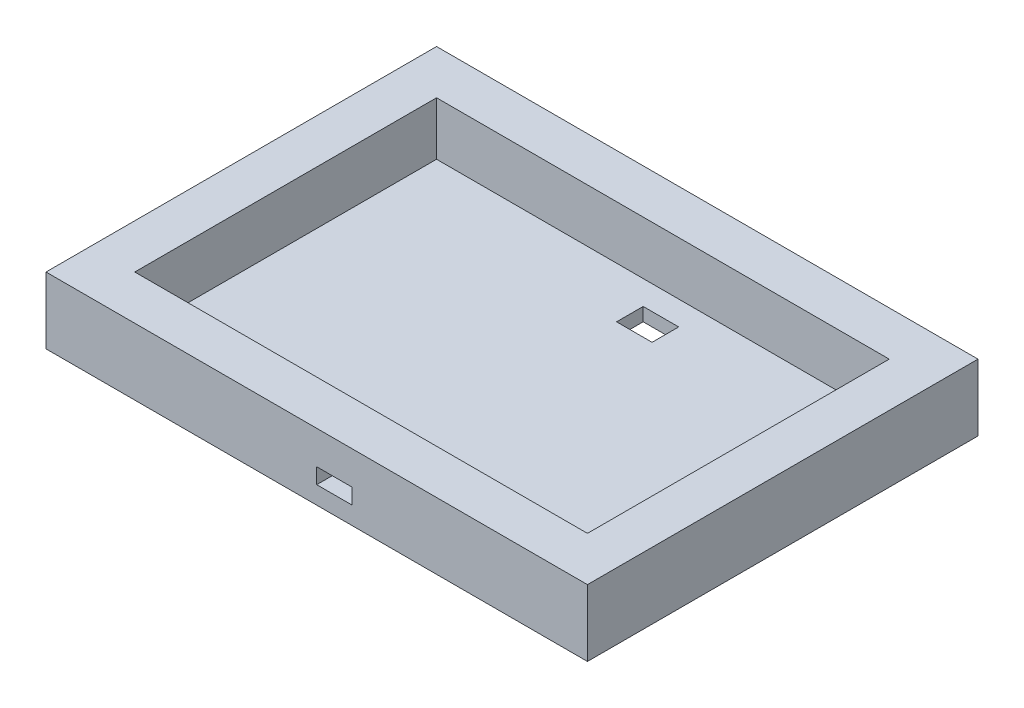
ISO-10303-21;
HEADER;
FILE_DESCRIPTION(('STEP AP214'),'2;1');
FILE_NAME('part.step','',(''),(''),'','','');
FILE_SCHEMA(('AUTOMOTIVE_DESIGN { 1 0 10303 214 1 1 1 1 }'));
ENDSEC;
DATA;
#1=APPLICATION_CONTEXT('core data for automotive mechanical design processes');
#2=APPLICATION_PROTOCOL_DEFINITION('international standard','automotive_design',2000,#1);
#3=PRODUCT_CONTEXT('',#1,'mechanical');
#4=PRODUCT('Part','Part','',(#3));
#5=PRODUCT_RELATED_PRODUCT_CATEGORY('part','',(#4));
#6=PRODUCT_DEFINITION_FORMATION('','',#4);
#7=PRODUCT_DEFINITION_CONTEXT('part definition',#1,'design');
#8=PRODUCT_DEFINITION('design','',#6,#7);
#9=PRODUCT_DEFINITION_SHAPE('','',#8);
#10=(LENGTH_UNIT() NAMED_UNIT(*) SI_UNIT(.MILLI.,.METRE.));
#11=(NAMED_UNIT(*) PLANE_ANGLE_UNIT() SI_UNIT($,.RADIAN.));
#12=(NAMED_UNIT(*) SI_UNIT($,.STERADIAN.) SOLID_ANGLE_UNIT());
#13=UNCERTAINTY_MEASURE_WITH_UNIT(LENGTH_MEASURE(1.E-05),#10,'distance_accuracy_value','');
#14=(GEOMETRIC_REPRESENTATION_CONTEXT(3) GLOBAL_UNCERTAINTY_ASSIGNED_CONTEXT((#13)) GLOBAL_UNIT_ASSIGNED_CONTEXT((#10,
#11,#12)) REPRESENTATION_CONTEXT('',''));
#15=CARTESIAN_POINT('',(0.,0.,0.));
#16=DIRECTION('',(0.,0.,1.));
#17=DIRECTION('',(1.,0.,0.));
#18=AXIS2_PLACEMENT_3D('',#15,#16,#17);
#19=CARTESIAN_POINT('',(-92.6082870260368,15.,47.5446963193695));
#20=DIRECTION('',(0.,0.,-1.));
#21=DIRECTION('',(-1.,0.,0.));
#22=AXIS2_PLACEMENT_3D('',#19,#20,#21);
#23=PLANE('',#22);
#24=DIRECTION('',(1.,0.,0.));
#25=VECTOR('',#24,1.);
#26=CARTESIAN_POINT('',(-92.6082870260368,0.,47.5446963193695));
#27=LINE('',#26,#25);
#28=CARTESIAN_POINT('',(-92.6082870260368,0.,47.5446963193695));
#29=VERTEX_POINT('',#28);
#30=CARTESIAN_POINT('',(29.3917129739632,0.,47.5446963193695));
#31=VERTEX_POINT('',#30);
#32=EDGE_CURVE('E306',#29,#31,#27,.T.);
#33=ORIENTED_EDGE('',*,*,#32,.T.);
#34=DIRECTION('',(0.,-1.,0.));
#35=VECTOR('',#34,1.);
#36=CARTESIAN_POINT('',(29.3917129739632,15.,47.5446963193695));
#37=LINE('',#36,#35);
#38=CARTESIAN_POINT('',(29.3917129739632,15.,47.5446963193695));
#39=VERTEX_POINT('',#38);
#40=EDGE_CURVE('E48',#39,#31,#37,.T.);
#41=ORIENTED_EDGE('',*,*,#40,.F.);
#42=DIRECTION('',(1.,0.,0.));
#43=VECTOR('',#42,1.);
#44=CARTESIAN_POINT('',(-92.6082870260368,15.,47.5446963193695));
#45=LINE('',#44,#43);
#46=CARTESIAN_POINT('',(-92.6082870260368,15.,47.5446963193695));
#47=VERTEX_POINT('',#46);
#48=EDGE_CURVE('E292',#47,#39,#45,.T.);
#49=ORIENTED_EDGE('',*,*,#48,.F.);
#50=DIRECTION('',(0.,-1.,0.));
#51=VECTOR('',#50,1.);
#52=CARTESIAN_POINT('',(-92.6082870260368,15.,47.5446963193695));
#53=LINE('',#52,#51);
#54=EDGE_CURVE('E11',#47,#29,#53,.T.);
#55=ORIENTED_EDGE('',*,*,#54,.T.);
#56=EDGE_LOOP('',(#33,#41,#49,#55));
#57=FACE_BOUND('',#56,.T.);
#58=DIRECTION('',(0.,-1.,0.));
#59=VECTOR('',#58,1.);
#60=CARTESIAN_POINT('',(-31.6082870260368,15.,47.5446963193695));
#61=LINE('',#60,#59);
#62=CARTESIAN_POINT('',(-31.6082870260368,7.49999999999999,47.5446963193695));
#63=VERTEX_POINT('',#62);
#64=CARTESIAN_POINT('',(-31.6082870260368,3.99999999999999,47.5446963193695));
#65=VERTEX_POINT('',#64);
#66=EDGE_CURVE('E240',#63,#65,#61,.T.);
#67=ORIENTED_EDGE('',*,*,#66,.F.);
#68=DIRECTION('',(-1.,0.,0.));
#69=VECTOR('',#68,1.);
#70=CARTESIAN_POINT('',(-92.6082870260368,7.49999999999998,47.5446963193695));
#71=LINE('',#70,#69);
#72=CARTESIAN_POINT('',(-23.6082870260368,7.49999999999999,47.5446963193695));
#73=VERTEX_POINT('',#72);
#74=EDGE_CURVE('E230',#73,#63,#71,.T.);
#75=ORIENTED_EDGE('',*,*,#74,.F.);
#76=DIRECTION('',(0.,1.,0.));
#77=VECTOR('',#76,1.);
#78=CARTESIAN_POINT('',(-23.6082870260368,14.9999999999999,47.5446963193695));
#79=LINE('',#78,#77);
#80=CARTESIAN_POINT('',(-23.6082870260368,3.99999999999999,47.5446963193695));
#81=VERTEX_POINT('',#80);
#82=EDGE_CURVE('E233',#81,#73,#79,.T.);
#83=ORIENTED_EDGE('',*,*,#82,.F.);
#84=DIRECTION('',(1.,0.,0.));
#85=VECTOR('',#84,1.);
#86=CARTESIAN_POINT('',(-92.6082870260368,3.99999999999999,47.5446963193695));
#87=LINE('',#86,#85);
#88=EDGE_CURVE('E237',#65,#81,#87,.T.);
#89=ORIENTED_EDGE('',*,*,#88,.F.);
#90=EDGE_LOOP('',(#67,#75,#83,#89));
#91=FACE_BOUND('',#90,.T.);
#92=ADVANCED_FACE('F39',(#57,#91),#23,.F.);
#93=CARTESIAN_POINT('',(-82.6082870260368,15.,37.5446963193695));
#94=DIRECTION('',(0.,0.,-1.));
#95=DIRECTION('',(-1.,0.,0.));
#96=AXIS2_PLACEMENT_3D('',#93,#94,#95);
#97=PLANE('',#96);
#98=DIRECTION('',(1.,0.,0.));
#99=VECTOR('',#98,1.);
#100=CARTESIAN_POINT('',(-82.6082870260368,3.,37.5446963193695));
#101=LINE('',#100,#99);
#102=CARTESIAN_POINT('',(-82.6082870260368,3.,37.5446963193695));
#103=VERTEX_POINT('',#102);
#104=CARTESIAN_POINT('',(19.3917129739632,3.,37.5446963193695));
#105=VERTEX_POINT('',#104);
#106=EDGE_CURVE('E247',#103,#105,#101,.T.);
#107=ORIENTED_EDGE('',*,*,#106,.F.);
#108=DIRECTION('',(0.,-1.,0.));
#109=VECTOR('',#108,1.);
#110=CARTESIAN_POINT('',(-82.6082870260368,15.,37.5446963193695));
#111=LINE('',#110,#109);
#112=CARTESIAN_POINT('',(-82.6082870260368,15.,37.5446963193695));
#113=VERTEX_POINT('',#112);
#114=EDGE_CURVE('E283',#113,#103,#111,.T.);
#115=ORIENTED_EDGE('',*,*,#114,.F.);
#116=DIRECTION('',(1.,0.,0.));
#117=VECTOR('',#116,1.);
#118=CARTESIAN_POINT('',(-82.6082870260368,15.,37.5446963193695));
#119=LINE('',#118,#117);
#120=CARTESIAN_POINT('',(19.3917129739632,15.,37.5446963193695));
#121=VERTEX_POINT('',#120);
#122=EDGE_CURVE('E262',#113,#121,#119,.T.);
#123=ORIENTED_EDGE('',*,*,#122,.T.);
#124=DIRECTION('',(0.,-1.,0.));
#125=VECTOR('',#124,1.);
#126=CARTESIAN_POINT('',(19.3917129739632,15.,37.5446963193695));
#127=LINE('',#126,#125);
#128=EDGE_CURVE('E279',#121,#105,#127,.T.);
#129=ORIENTED_EDGE('',*,*,#128,.T.);
#130=EDGE_LOOP('',(#107,#115,#123,#129));
#131=FACE_BOUND('',#130,.T.);
#132=DIRECTION('',(-1.,0.,0.));
#133=VECTOR('',#132,1.);
#134=CARTESIAN_POINT('',(-23.6082870260368,7.49999999999999,37.5446963193695));
#135=LINE('',#134,#133);
#136=CARTESIAN_POINT('',(-23.6082870260368,7.49999999999999,37.5446963193695));
#137=VERTEX_POINT('',#136);
#138=CARTESIAN_POINT('',(-31.6082870260368,7.49999999999999,37.5446963193695));
#139=VERTEX_POINT('',#138);
#140=EDGE_CURVE('E211',#137,#139,#135,.T.);
#141=ORIENTED_EDGE('',*,*,#140,.T.);
#142=DIRECTION('',(0.,-1.,0.));
#143=VECTOR('',#142,1.);
#144=CARTESIAN_POINT('',(-31.6082870260368,3.99999999999999,37.5446963193695));
#145=LINE('',#144,#143);
#146=CARTESIAN_POINT('',(-31.6082870260368,3.99999999999999,37.5446963193695));
#147=VERTEX_POINT('',#146);
#148=EDGE_CURVE('E196',#139,#147,#145,.T.);
#149=ORIENTED_EDGE('',*,*,#148,.T.);
#150=DIRECTION('',(1.,0.,0.));
#151=VECTOR('',#150,1.);
#152=CARTESIAN_POINT('',(-23.6082870260368,3.99999999999999,37.5446963193695));
#153=LINE('',#152,#151);
#154=CARTESIAN_POINT('',(-23.6082870260368,3.99999999999999,37.5446963193695));
#155=VERTEX_POINT('',#154);
#156=EDGE_CURVE('E202',#147,#155,#153,.T.);
#157=ORIENTED_EDGE('',*,*,#156,.T.);
#158=DIRECTION('',(0.,1.,0.));
#159=VECTOR('',#158,1.);
#160=CARTESIAN_POINT('',(-23.6082870260368,3.99999999999999,37.5446963193695));
#161=LINE('',#160,#159);
#162=EDGE_CURVE('E207',#155,#137,#161,.T.);
#163=ORIENTED_EDGE('',*,*,#162,.T.);
#164=EDGE_LOOP('',(#141,#149,#157,#163));
#165=FACE_BOUND('',#164,.T.);
#166=ADVANCED_FACE('F343',(#131,#165),#97,.T.);
#167=CARTESIAN_POINT('',(0.,15.,0.));
#168=DIRECTION('',(0.,1.,0.));
#169=DIRECTION('',(0.,0.,1.));
#170=AXIS2_PLACEMENT_3D('',#167,#168,#169);
#171=PLANE('',#170);
#172=DIRECTION('',(0.,0.,1.));
#173=VECTOR('',#172,1.);
#174=CARTESIAN_POINT('',(-92.6082870260368,15.,-40.4553036806305));
#175=LINE('',#174,#173);
#176=CARTESIAN_POINT('',(-92.6082870260368,15.,-40.4553036806305));
#177=VERTEX_POINT('',#176);
#178=EDGE_CURVE('E288',#177,#47,#175,.T.);
#179=ORIENTED_EDGE('',*,*,#178,.T.);
#180=ORIENTED_EDGE('',*,*,#48,.T.);
#181=DIRECTION('',(0.,0.,-1.));
#182=VECTOR('',#181,1.);
#183=CARTESIAN_POINT('',(29.3917129739632,15.,-40.4553036806305));
#184=LINE('',#183,#182);
#185=CARTESIAN_POINT('',(29.3917129739632,15.,-40.4553036806305));
#186=VERTEX_POINT('',#185);
#187=EDGE_CURVE('E296',#39,#186,#184,.T.);
#188=ORIENTED_EDGE('',*,*,#187,.T.);
#189=DIRECTION('',(-1.,0.,0.));
#190=VECTOR('',#189,1.);
#191=CARTESIAN_POINT('',(-92.6082870260368,15.,-40.4553036806305));
#192=LINE('',#191,#190);
#193=EDGE_CURVE('E299',#186,#177,#192,.T.);
#194=ORIENTED_EDGE('',*,*,#193,.T.);
#195=EDGE_LOOP('',(#179,#180,#188,#194));
#196=FACE_BOUND('',#195,.T.);
#197=ORIENTED_EDGE('',*,*,#122,.F.);
#198=DIRECTION('',(0.,0.,1.));
#199=VECTOR('',#198,1.);
#200=CARTESIAN_POINT('',(-82.6082870260368,15.,-30.4553036806305));
#201=LINE('',#200,#199);
#202=CARTESIAN_POINT('',(-82.6082870260368,15.,-30.4553036806305));
#203=VERTEX_POINT('',#202);
#204=EDGE_CURVE('E259',#203,#113,#201,.T.);
#205=ORIENTED_EDGE('',*,*,#204,.F.);
#206=DIRECTION('',(-1.,0.,0.));
#207=VECTOR('',#206,1.);
#208=CARTESIAN_POINT('',(-82.6082870260368,15.,-30.4553036806305));
#209=LINE('',#208,#207);
#210=CARTESIAN_POINT('',(19.3917129739632,15.,-30.4553036806305));
#211=VERTEX_POINT('',#210);
#212=EDGE_CURVE('E269',#211,#203,#209,.T.);
#213=ORIENTED_EDGE('',*,*,#212,.F.);
#214=DIRECTION('',(0.,0.,-1.));
#215=VECTOR('',#214,1.);
#216=CARTESIAN_POINT('',(19.3917129739632,15.,-30.4553036806305));
#217=LINE('',#216,#215);
#218=EDGE_CURVE('E265',#121,#211,#217,.T.);
#219=ORIENTED_EDGE('',*,*,#218,.F.);
#220=EDGE_LOOP('',(#197,#205,#213,#219));
#221=FACE_BOUND('',#220,.T.);
#222=ADVANCED_FACE('F339',(#196,#221),#171,.T.);
#223=CARTESIAN_POINT('',(0.,0.,0.));
#224=DIRECTION('',(0.,1.,0.));
#225=DIRECTION('',(0.,0.,1.));
#226=AXIS2_PLACEMENT_3D('',#223,#224,#225);
#227=PLANE('',#226);
#228=DIRECTION('',(1.,0.,0.));
#229=VECTOR('',#228,1.);
#230=CARTESIAN_POINT('',(-22.6082870260368,0.,-19.0153036806305));
#231=LINE('',#230,#229);
#232=CARTESIAN_POINT('',(-30.6082870260368,0.,-19.0153036806305));
#233=VERTEX_POINT('',#232);
#234=CARTESIAN_POINT('',(-22.6082870260368,0.,-19.0153036806305));
#235=VERTEX_POINT('',#234);
#236=EDGE_CURVE('E162',#233,#235,#231,.T.);
#237=ORIENTED_EDGE('',*,*,#236,.T.);
#238=DIRECTION('',(0.,0.,-1.));
#239=VECTOR('',#238,1.);
#240=CARTESIAN_POINT('',(-22.6082870260368,0.,-25.0153036806305));
#241=LINE('',#240,#239);
#242=CARTESIAN_POINT('',(-22.6082870260368,0.,-25.0153036806305));
#243=VERTEX_POINT('',#242);
#244=EDGE_CURVE('E155',#235,#243,#241,.T.);
#245=ORIENTED_EDGE('',*,*,#244,.T.);
#246=DIRECTION('',(-1.,0.,0.));
#247=VECTOR('',#246,1.);
#248=CARTESIAN_POINT('',(-22.6082870260368,0.,-25.0153036806305));
#249=LINE('',#248,#247);
#250=CARTESIAN_POINT('',(-30.6082870260368,0.,-25.0153036806305));
#251=VERTEX_POINT('',#250);
#252=EDGE_CURVE('E165',#243,#251,#249,.T.);
#253=ORIENTED_EDGE('',*,*,#252,.T.);
#254=DIRECTION('',(0.,0.,1.));
#255=VECTOR('',#254,1.);
#256=CARTESIAN_POINT('',(-30.6082870260368,0.,-25.0153036806305));
#257=LINE('',#256,#255);
#258=EDGE_CURVE('E55',#251,#233,#257,.T.);
#259=ORIENTED_EDGE('',*,*,#258,.T.);
#260=EDGE_LOOP('',(#237,#245,#253,#259));
#261=FACE_BOUND('',#260,.T.);
#262=DIRECTION('',(0.,0.,1.));
#263=VECTOR('',#262,1.);
#264=CARTESIAN_POINT('',(-92.6082870260368,0.,-40.4553036806305));
#265=LINE('',#264,#263);
#266=CARTESIAN_POINT('',(-92.6082870260368,0.,-40.4553036806305));
#267=VERTEX_POINT('',#266);
#268=EDGE_CURVE('E287',#267,#29,#265,.T.);
#269=ORIENTED_EDGE('',*,*,#268,.F.);
#270=DIRECTION('',(-1.,0.,0.));
#271=VECTOR('',#270,1.);
#272=CARTESIAN_POINT('',(-92.6082870260368,0.,-40.4553036806305));
#273=LINE('',#272,#271);
#274=CARTESIAN_POINT('',(29.3917129739632,0.,-40.4553036806305));
#275=VERTEX_POINT('',#274);
#276=EDGE_CURVE('E293',#275,#267,#273,.T.);
#277=ORIENTED_EDGE('',*,*,#276,.F.);
#278=DIRECTION('',(0.,0.,-1.));
#279=VECTOR('',#278,1.);
#280=CARTESIAN_POINT('',(29.3917129739632,0.,-40.4553036806305));
#281=LINE('',#280,#279);
#282=EDGE_CURVE('E309',#31,#275,#281,.T.);
#283=ORIENTED_EDGE('',*,*,#282,.F.);
#284=ORIENTED_EDGE('',*,*,#32,.F.);
#285=EDGE_LOOP('',(#269,#277,#283,#284));
#286=FACE_BOUND('',#285,.T.);
#287=ADVANCED_FACE('F170',(#261,#286),#227,.F.);
#288=CARTESIAN_POINT('',(-92.6082870260368,15.,-40.4553036806305));
#289=DIRECTION('',(1.,0.,0.));
#290=DIRECTION('',(0.,0.,-1.));
#291=AXIS2_PLACEMENT_3D('',#288,#289,#290);
#292=PLANE('',#291);
#293=ORIENTED_EDGE('',*,*,#268,.T.);
#294=ORIENTED_EDGE('',*,*,#54,.F.);
#295=ORIENTED_EDGE('',*,*,#178,.F.);
#296=DIRECTION('',(0.,-1.,0.));
#297=VECTOR('',#296,1.);
#298=CARTESIAN_POINT('',(-92.6082870260368,15.,-40.4553036806305));
#299=LINE('',#298,#297);
#300=EDGE_CURVE('E302',#177,#267,#299,.T.);
#301=ORIENTED_EDGE('',*,*,#300,.T.);
#302=EDGE_LOOP('',(#293,#294,#295,#301));
#303=FACE_BOUND('',#302,.T.);
#304=ADVANCED_FACE('F41',(#303),#292,.F.);
#305=CARTESIAN_POINT('',(29.3917129739632,15.,-40.4553036806305));
#306=DIRECTION('',(-1.,0.,0.));
#307=DIRECTION('',(0.,0.,1.));
#308=AXIS2_PLACEMENT_3D('',#305,#306,#307);
#309=PLANE('',#308);
#310=ORIENTED_EDGE('',*,*,#282,.T.);
#311=DIRECTION('',(0.,-1.,0.));
#312=VECTOR('',#311,1.);
#313=CARTESIAN_POINT('',(29.3917129739632,15.,-40.4553036806305));
#314=LINE('',#313,#312);
#315=EDGE_CURVE('E317',#186,#275,#314,.T.);
#316=ORIENTED_EDGE('',*,*,#315,.F.);
#317=ORIENTED_EDGE('',*,*,#187,.F.);
#318=ORIENTED_EDGE('',*,*,#40,.T.);
#319=EDGE_LOOP('',(#310,#316,#317,#318));
#320=FACE_BOUND('',#319,.T.);
#321=ADVANCED_FACE('F326',(#320),#309,.F.);
#322=CARTESIAN_POINT('',(-92.6082870260368,15.,-40.4553036806305));
#323=DIRECTION('',(0.,0.,1.));
#324=DIRECTION('',(1.,0.,0.));
#325=AXIS2_PLACEMENT_3D('',#322,#323,#324);
#326=PLANE('',#325);
#327=ORIENTED_EDGE('',*,*,#276,.T.);
#328=ORIENTED_EDGE('',*,*,#300,.F.);
#329=ORIENTED_EDGE('',*,*,#193,.F.);
#330=ORIENTED_EDGE('',*,*,#315,.T.);
#331=EDGE_LOOP('',(#327,#328,#329,#330));
#332=FACE_BOUND('',#331,.T.);
#333=ADVANCED_FACE('F333',(#332),#326,.F.);
#334=CARTESIAN_POINT('',(-82.6082870260368,15.,-30.4553036806305));
#335=DIRECTION('',(1.,0.,0.));
#336=DIRECTION('',(0.,0.,-1.));
#337=AXIS2_PLACEMENT_3D('',#334,#335,#336);
#338=PLANE('',#337);
#339=DIRECTION('',(0.,0.,1.));
#340=VECTOR('',#339,1.);
#341=CARTESIAN_POINT('',(-82.6082870260368,3.,-30.4553036806305));
#342=LINE('',#341,#340);
#343=CARTESIAN_POINT('',(-82.6082870260368,3.,-30.4553036806305));
#344=VERTEX_POINT('',#343);
#345=EDGE_CURVE('E243',#344,#103,#342,.T.);
#346=ORIENTED_EDGE('',*,*,#345,.F.);
#347=DIRECTION('',(0.,-1.,0.));
#348=VECTOR('',#347,1.);
#349=CARTESIAN_POINT('',(-82.6082870260368,15.,-30.4553036806305));
#350=LINE('',#349,#348);
#351=EDGE_CURVE('E272',#203,#344,#350,.T.);
#352=ORIENTED_EDGE('',*,*,#351,.F.);
#353=ORIENTED_EDGE('',*,*,#204,.T.);
#354=ORIENTED_EDGE('',*,*,#114,.T.);
#355=EDGE_LOOP('',(#346,#352,#353,#354));
#356=FACE_BOUND('',#355,.T.);
#357=ADVANCED_FACE('F386',(#356),#338,.T.);
#358=CARTESIAN_POINT('',(19.3917129739632,15.,-30.4553036806305));
#359=DIRECTION('',(-1.,0.,0.));
#360=DIRECTION('',(0.,0.,1.));
#361=AXIS2_PLACEMENT_3D('',#358,#359,#360);
#362=PLANE('',#361);
#363=DIRECTION('',(0.,0.,-1.));
#364=VECTOR('',#363,1.);
#365=CARTESIAN_POINT('',(19.3917129739632,3.,-30.4553036806305));
#366=LINE('',#365,#364);
#367=CARTESIAN_POINT('',(19.3917129739632,3.,-30.4553036806305));
#368=VERTEX_POINT('',#367);
#369=EDGE_CURVE('E251',#105,#368,#366,.T.);
#370=ORIENTED_EDGE('',*,*,#369,.F.);
#371=ORIENTED_EDGE('',*,*,#128,.F.);
#372=ORIENTED_EDGE('',*,*,#218,.T.);
#373=DIRECTION('',(0.,-1.,0.));
#374=VECTOR('',#373,1.);
#375=CARTESIAN_POINT('',(19.3917129739632,15.,-30.4553036806305));
#376=LINE('',#375,#374);
#377=EDGE_CURVE('E275',#211,#368,#376,.T.);
#378=ORIENTED_EDGE('',*,*,#377,.T.);
#379=EDGE_LOOP('',(#370,#371,#372,#378));
#380=FACE_BOUND('',#379,.T.);
#381=ADVANCED_FACE('F382',(#380),#362,.T.);
#382=CARTESIAN_POINT('',(-82.6082870260368,15.,-30.4553036806305));
#383=DIRECTION('',(0.,0.,1.));
#384=DIRECTION('',(1.,0.,0.));
#385=AXIS2_PLACEMENT_3D('',#382,#383,#384);
#386=PLANE('',#385);
#387=DIRECTION('',(-1.,0.,0.));
#388=VECTOR('',#387,1.);
#389=CARTESIAN_POINT('',(-82.6082870260368,3.,-30.4553036806305));
#390=LINE('',#389,#388);
#391=EDGE_CURVE('E255',#368,#344,#390,.T.);
#392=ORIENTED_EDGE('',*,*,#391,.F.);
#393=ORIENTED_EDGE('',*,*,#377,.F.);
#394=ORIENTED_EDGE('',*,*,#212,.T.);
#395=ORIENTED_EDGE('',*,*,#351,.T.);
#396=EDGE_LOOP('',(#392,#393,#394,#395));
#397=FACE_BOUND('',#396,.T.);
#398=ADVANCED_FACE('F378',(#397),#386,.T.);
#399=CARTESIAN_POINT('',(0.,3.,0.));
#400=DIRECTION('',(0.,1.,0.));
#401=DIRECTION('',(0.,0.,1.));
#402=AXIS2_PLACEMENT_3D('',#399,#400,#401);
#403=PLANE('',#402);
#404=DIRECTION('',(0.,0.,-1.));
#405=VECTOR('',#404,1.);
#406=CARTESIAN_POINT('',(-22.6082870260368,3.,-25.0153036806305));
#407=LINE('',#406,#405);
#408=CARTESIAN_POINT('',(-22.6082870260368,3.,-19.0153036806305));
#409=VERTEX_POINT('',#408);
#410=CARTESIAN_POINT('',(-22.6082870260368,3.,-25.0153036806305));
#411=VERTEX_POINT('',#410);
#412=EDGE_CURVE('E63',#409,#411,#407,.T.);
#413=ORIENTED_EDGE('',*,*,#412,.F.);
#414=DIRECTION('',(1.,0.,0.));
#415=VECTOR('',#414,1.);
#416=CARTESIAN_POINT('',(-22.6082870260368,3.,-19.0153036806305));
#417=LINE('',#416,#415);
#418=CARTESIAN_POINT('',(-30.6082870260368,3.,-19.0153036806305));
#419=VERTEX_POINT('',#418);
#420=EDGE_CURVE('E174',#419,#409,#417,.T.);
#421=ORIENTED_EDGE('',*,*,#420,.F.);
#422=DIRECTION('',(0.,0.,1.));
#423=VECTOR('',#422,1.);
#424=CARTESIAN_POINT('',(-30.6082870260368,3.,-25.0153036806305));
#425=LINE('',#424,#423);
#426=CARTESIAN_POINT('',(-30.6082870260368,3.,-25.0153036806305));
#427=VERTEX_POINT('',#426);
#428=EDGE_CURVE('E178',#427,#419,#425,.T.);
#429=ORIENTED_EDGE('',*,*,#428,.F.);
#430=DIRECTION('',(-1.,0.,0.));
#431=VECTOR('',#430,1.);
#432=CARTESIAN_POINT('',(-22.6082870260368,3.,-25.0153036806305));
#433=LINE('',#432,#431);
#434=EDGE_CURVE('E187',#411,#427,#433,.T.);
#435=ORIENTED_EDGE('',*,*,#434,.F.);
#436=EDGE_LOOP('',(#413,#421,#429,#435));
#437=FACE_BOUND('',#436,.T.);
#438=ORIENTED_EDGE('',*,*,#345,.T.);
#439=ORIENTED_EDGE('',*,*,#106,.T.);
#440=ORIENTED_EDGE('',*,*,#369,.T.);
#441=ORIENTED_EDGE('',*,*,#391,.T.);
#442=EDGE_LOOP('',(#438,#439,#440,#441));
#443=FACE_BOUND('',#442,.T.);
#444=ADVANCED_FACE('F375',(#437,#443),#403,.T.);
#445=CARTESIAN_POINT('',(-31.6082870260368,3.99999999999999,47.5447083193695));
#446=DIRECTION('',(1.,0.,0.));
#447=DIRECTION('',(0.,0.,-1.));
#448=AXIS2_PLACEMENT_3D('',#445,#446,#447);
#449=PLANE('',#448);
#450=ORIENTED_EDGE('',*,*,#66,.T.);
#451=DIRECTION('',(0.,0.,-1.));
#452=VECTOR('',#451,1.);
#453=CARTESIAN_POINT('',(-31.6082870260368,3.99999999999999,47.5447083193695));
#454=LINE('',#453,#452);
#455=EDGE_CURVE('E227',#65,#147,#454,.T.);
#456=ORIENTED_EDGE('',*,*,#455,.T.);
#457=ORIENTED_EDGE('',*,*,#148,.F.);
#458=DIRECTION('',(0.,0.,-1.));
#459=VECTOR('',#458,1.);
#460=CARTESIAN_POINT('',(-31.6082870260368,7.49999999999999,47.5447083193695));
#461=LINE('',#460,#459);
#462=EDGE_CURVE('E206',#63,#139,#461,.T.);
#463=ORIENTED_EDGE('',*,*,#462,.F.);
#464=EDGE_LOOP('',(#450,#456,#457,#463));
#465=FACE_BOUND('',#464,.T.);
#466=ADVANCED_FACE('F351',(#465),#449,.T.);
#467=CARTESIAN_POINT('',(-23.6082870260368,3.99999999999999,47.5447083193695));
#468=DIRECTION('',(0.,1.,0.));
#469=DIRECTION('',(-1.,0.,0.));
#470=AXIS2_PLACEMENT_3D('',#467,#468,#469);
#471=PLANE('',#470);
#472=ORIENTED_EDGE('',*,*,#88,.T.);
#473=DIRECTION('',(0.,0.,-1.));
#474=VECTOR('',#473,1.);
#475=CARTESIAN_POINT('',(-23.6082870260368,3.99999999999999,47.5447083193695));
#476=LINE('',#475,#474);
#477=EDGE_CURVE('E224',#81,#155,#476,.T.);
#478=ORIENTED_EDGE('',*,*,#477,.T.);
#479=ORIENTED_EDGE('',*,*,#156,.F.);
#480=ORIENTED_EDGE('',*,*,#455,.F.);
#481=EDGE_LOOP('',(#472,#478,#479,#480));
#482=FACE_BOUND('',#481,.T.);
#483=ADVANCED_FACE('F354',(#482),#471,.T.);
#484=CARTESIAN_POINT('',(-23.6082870260368,3.99999999999999,47.5447083193695));
#485=DIRECTION('',(-1.,0.,0.));
#486=DIRECTION('',(0.,-1.,0.));
#487=AXIS2_PLACEMENT_3D('',#484,#485,#486);
#488=PLANE('',#487);
#489=ORIENTED_EDGE('',*,*,#82,.T.);
#490=DIRECTION('',(0.,0.,-1.));
#491=VECTOR('',#490,1.);
#492=CARTESIAN_POINT('',(-23.6082870260368,7.49999999999999,47.5447083193695));
#493=LINE('',#492,#491);
#494=EDGE_CURVE('E221',#73,#137,#493,.T.);
#495=ORIENTED_EDGE('',*,*,#494,.T.);
#496=ORIENTED_EDGE('',*,*,#162,.F.);
#497=ORIENTED_EDGE('',*,*,#477,.F.);
#498=EDGE_LOOP('',(#489,#495,#496,#497));
#499=FACE_BOUND('',#498,.T.);
#500=ADVANCED_FACE('F362',(#499),#488,.T.);
#501=CARTESIAN_POINT('',(-23.6082870260368,7.49999999999999,47.5447083193695));
#502=DIRECTION('',(0.,-1.,0.));
#503=DIRECTION('',(1.,0.,0.));
#504=AXIS2_PLACEMENT_3D('',#501,#502,#503);
#505=PLANE('',#504);
#506=ORIENTED_EDGE('',*,*,#74,.T.);
#507=ORIENTED_EDGE('',*,*,#462,.T.);
#508=ORIENTED_EDGE('',*,*,#140,.F.);
#509=ORIENTED_EDGE('',*,*,#494,.F.);
#510=EDGE_LOOP('',(#506,#507,#508,#509));
#511=FACE_BOUND('',#510,.T.);
#512=ADVANCED_FACE('F360',(#511),#505,.T.);
#513=CARTESIAN_POINT('',(-22.6082870260368,0.,-25.0153036806305));
#514=DIRECTION('',(1.,0.,0.));
#515=DIRECTION('',(0.,0.,-1.));
#516=AXIS2_PLACEMENT_3D('',#513,#514,#515);
#517=PLANE('',#516);
#518=ORIENTED_EDGE('',*,*,#412,.T.);
#519=DIRECTION('',(0.,1.,0.));
#520=VECTOR('',#519,1.);
#521=CARTESIAN_POINT('',(-22.6082870260368,0.,-25.0153036806305));
#522=LINE('',#521,#520);
#523=EDGE_CURVE('E151',#243,#411,#522,.T.);
#524=ORIENTED_EDGE('',*,*,#523,.F.);
#525=ORIENTED_EDGE('',*,*,#244,.F.);
#526=DIRECTION('',(0.,1.,0.));
#527=VECTOR('',#526,1.);
#528=CARTESIAN_POINT('',(-22.6082870260368,0.,-19.0153036806305));
#529=LINE('',#528,#527);
#530=EDGE_CURVE('E193',#235,#409,#529,.T.);
#531=ORIENTED_EDGE('',*,*,#530,.T.);
#532=EDGE_LOOP('',(#518,#524,#525,#531));
#533=FACE_BOUND('',#532,.T.);
#534=ADVANCED_FACE('F153',(#533),#517,.F.);
#535=CARTESIAN_POINT('',(-22.6082870260368,0.,-19.0153036806305));
#536=DIRECTION('',(0.,0.,1.));
#537=DIRECTION('',(1.,0.,0.));
#538=AXIS2_PLACEMENT_3D('',#535,#536,#537);
#539=PLANE('',#538);
#540=ORIENTED_EDGE('',*,*,#420,.T.);
#541=ORIENTED_EDGE('',*,*,#530,.F.);
#542=ORIENTED_EDGE('',*,*,#236,.F.);
#543=DIRECTION('',(0.,1.,0.));
#544=VECTOR('',#543,1.);
#545=CARTESIAN_POINT('',(-30.6082870260368,0.,-19.0153036806305));
#546=LINE('',#545,#544);
#547=EDGE_CURVE('E197',#233,#419,#546,.T.);
#548=ORIENTED_EDGE('',*,*,#547,.T.);
#549=EDGE_LOOP('',(#540,#541,#542,#548));
#550=FACE_BOUND('',#549,.T.);
#551=ADVANCED_FACE('F479',(#550),#539,.F.);
#552=CARTESIAN_POINT('',(-30.6082870260368,0.,-25.0153036806305));
#553=DIRECTION('',(-1.,0.,0.));
#554=DIRECTION('',(0.,0.,1.));
#555=AXIS2_PLACEMENT_3D('',#552,#553,#554);
#556=PLANE('',#555);
#557=ORIENTED_EDGE('',*,*,#428,.T.);
#558=ORIENTED_EDGE('',*,*,#547,.F.);
#559=ORIENTED_EDGE('',*,*,#258,.F.);
#560=DIRECTION('',(0.,1.,0.));
#561=VECTOR('',#560,1.);
#562=CARTESIAN_POINT('',(-30.6082870260368,0.,-25.0153036806305));
#563=LINE('',#562,#561);
#564=EDGE_CURVE('E161',#251,#427,#563,.T.);
#565=ORIENTED_EDGE('',*,*,#564,.T.);
#566=EDGE_LOOP('',(#557,#558,#559,#565));
#567=FACE_BOUND('',#566,.T.);
#568=ADVANCED_FACE('F488',(#567),#556,.F.);
#569=CARTESIAN_POINT('',(-22.6082870260368,0.,-25.0153036806305));
#570=DIRECTION('',(0.,0.,-1.));
#571=DIRECTION('',(-1.,0.,0.));
#572=AXIS2_PLACEMENT_3D('',#569,#570,#571);
#573=PLANE('',#572);
#574=ORIENTED_EDGE('',*,*,#434,.T.);
#575=ORIENTED_EDGE('',*,*,#564,.F.);
#576=ORIENTED_EDGE('',*,*,#252,.F.);
#577=ORIENTED_EDGE('',*,*,#523,.T.);
#578=EDGE_LOOP('',(#574,#575,#576,#577));
#579=FACE_BOUND('',#578,.T.);
#580=ADVANCED_FACE('F166',(#579),#573,.F.);
#581=CLOSED_SHELL('',(#92,#166,#222,#287,#304,#321,#333,#357,#381,#398,#444,#466,#483,#500,#512,
#534,#551,#568,#580));
#582=MANIFOLD_SOLID_BREP('B2',#581);
#583=ADVANCED_BREP_SHAPE_REPRESENTATION('',(#18,#582),#14);
#584=SHAPE_DEFINITION_REPRESENTATION(#9,#583);
ENDSEC;
END-ISO-10303-21;
